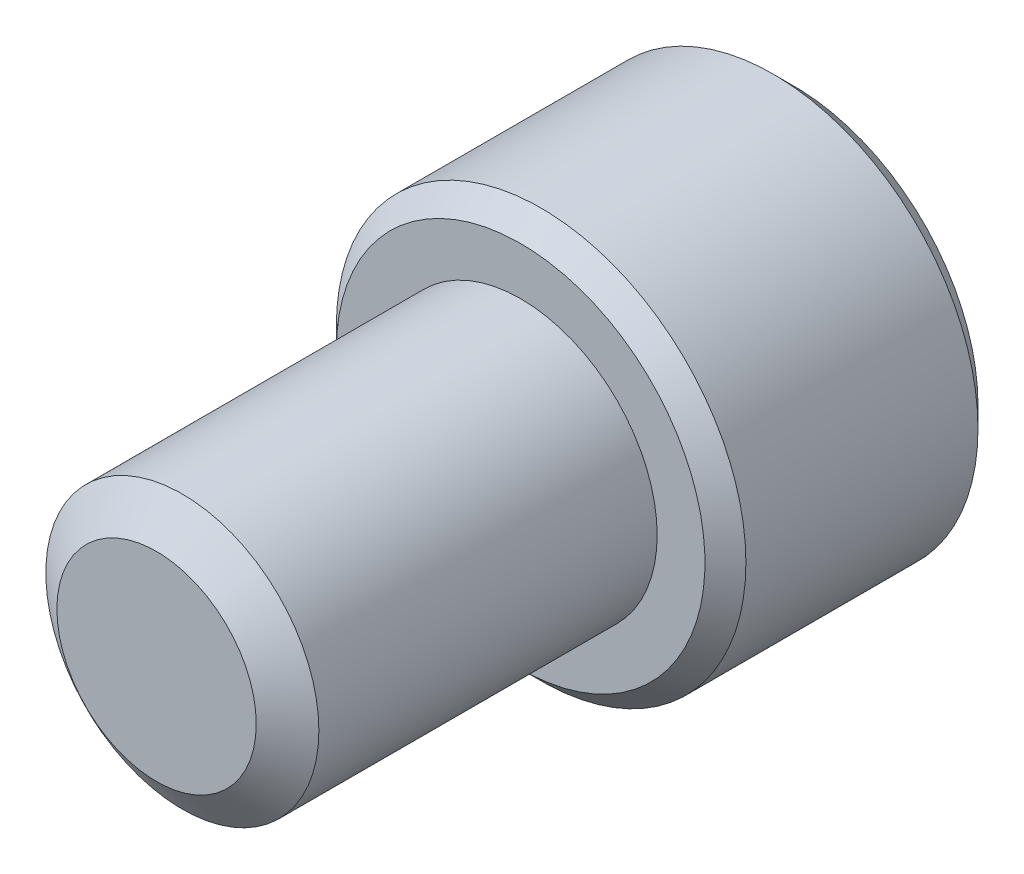
ISO-10303-21;
HEADER;
FILE_DESCRIPTION(('STEP AP214'),'2;1');
FILE_NAME('part.step','',(''),(''),'','','');
FILE_SCHEMA(('AUTOMOTIVE_DESIGN { 1 0 10303 214 1 1 1 1 }'));
ENDSEC;
DATA;
#1=APPLICATION_CONTEXT('core data for automotive mechanical design processes');
#2=APPLICATION_PROTOCOL_DEFINITION('international standard','automotive_design',2000,#1);
#3=PRODUCT_CONTEXT('',#1,'mechanical');
#4=PRODUCT('Part','Part','',(#3));
#5=PRODUCT_RELATED_PRODUCT_CATEGORY('part','',(#4));
#6=PRODUCT_DEFINITION_FORMATION('','',#4);
#7=PRODUCT_DEFINITION_CONTEXT('part definition',#1,'design');
#8=PRODUCT_DEFINITION('design','',#6,#7);
#9=PRODUCT_DEFINITION_SHAPE('','',#8);
#10=(LENGTH_UNIT() NAMED_UNIT(*) SI_UNIT(.MILLI.,.METRE.));
#11=(NAMED_UNIT(*) PLANE_ANGLE_UNIT() SI_UNIT($,.RADIAN.));
#12=(NAMED_UNIT(*) SI_UNIT($,.STERADIAN.) SOLID_ANGLE_UNIT());
#13=UNCERTAINTY_MEASURE_WITH_UNIT(LENGTH_MEASURE(1.E-05),#10,'distance_accuracy_value','');
#14=(GEOMETRIC_REPRESENTATION_CONTEXT(3) GLOBAL_UNCERTAINTY_ASSIGNED_CONTEXT((#13)) GLOBAL_UNIT_ASSIGNED_CONTEXT((#10,
#11,#12)) REPRESENTATION_CONTEXT('',''));
#15=CARTESIAN_POINT('',(0.,0.,0.));
#16=DIRECTION('',(0.,0.,1.));
#17=DIRECTION('',(1.,0.,0.));
#18=AXIS2_PLACEMENT_3D('',#15,#16,#17);
#19=CARTESIAN_POINT('',(0.,0.,-12.7));
#20=DIRECTION('',(0.,0.,1.));
#21=DIRECTION('',(1.,0.,0.));
#22=AXIS2_PLACEMENT_3D('',#19,#20,#21);
#23=CYLINDRICAL_SURFACE('',#22,4.7625);
#24=CARTESIAN_POINT('',(0.,0.,-12.7));
#25=DIRECTION('',(0.,0.,-1.));
#26=DIRECTION('',(-1.,0.,0.));
#27=AXIS2_PLACEMENT_3D('',#24,#25,#26);
#28=CIRCLE('',#27,4.7625);
#29=CARTESIAN_POINT('',(-4.7625,0.,-12.7));
#30=VERTEX_POINT('',#29);
#31=EDGE_CURVE('E217',#30,#30,#28,.F.);
#32=ORIENTED_EDGE('',*,*,#31,.T.);
#33=EDGE_LOOP('',(#32));
#34=FACE_BOUND('',#33,.T.);
#35=CARTESIAN_POINT('',(0.,0.,-0.899844757205829));
#36=DIRECTION('',(0.,0.,1.));
#37=DIRECTION('',(1.,0.,0.));
#38=AXIS2_PLACEMENT_3D('',#35,#36,#37);
#39=CIRCLE('',#38,4.7625);
#40=CARTESIAN_POINT('',(4.7625,0.,-0.899844757205829));
#41=VERTEX_POINT('',#40);
#42=EDGE_CURVE('E111',#41,#41,#39,.T.);
#43=ORIENTED_EDGE('',*,*,#42,.F.);
#44=EDGE_LOOP('',(#43));
#45=FACE_BOUND('',#44,.T.);
#46=ADVANCED_FACE('F37',(#34,#45),#23,.T.);
#47=CARTESIAN_POINT('',(0.,0.,0.));
#48=DIRECTION('',(0.,0.,-1.));
#49=DIRECTION('',(-1.,0.,0.));
#50=AXIS2_PLACEMENT_3D('',#47,#48,#49);
#51=CONICAL_SURFACE('',#50,3.47738850361915,0.959931088596884);
#52=ORIENTED_EDGE('',*,*,#42,.T.);
#53=EDGE_LOOP('',(#52));
#54=FACE_BOUND('',#53,.T.);
#55=CARTESIAN_POINT('',(0.,0.,0.));
#56=DIRECTION('',(0.,0.,1.));
#57=DIRECTION('',(1.,0.,0.));
#58=AXIS2_PLACEMENT_3D('',#55,#56,#57);
#59=CIRCLE('',#58,3.47738850361915);
#60=CARTESIAN_POINT('',(3.47738850361915,0.,0.));
#61=VERTEX_POINT('',#60);
#62=EDGE_CURVE('E215',#61,#61,#59,.T.);
#63=ORIENTED_EDGE('',*,*,#62,.F.);
#64=EDGE_LOOP('',(#63));
#65=FACE_BOUND('',#64,.T.);
#66=ADVANCED_FACE('F198',(#54,#65),#51,.T.);
#67=CARTESIAN_POINT('',(0.,0.,0.));
#68=DIRECTION('',(0.,0.,1.));
#69=DIRECTION('',(1.,0.,0.));
#70=AXIS2_PLACEMENT_3D('',#67,#68,#69);
#71=PLANE('',#70);
#72=ORIENTED_EDGE('',*,*,#62,.T.);
#73=EDGE_LOOP('',(#72));
#74=FACE_BOUND('',#73,.T.);
#75=ADVANCED_FACE('F195',(#74),#71,.T.);
#76=CARTESIAN_POINT('',(0.,0.,-22.225));
#77=DIRECTION('',(0.,0.,1.));
#78=DIRECTION('',(1.,0.,0.));
#79=AXIS2_PLACEMENT_3D('',#76,#77,#78);
#80=CYLINDRICAL_SURFACE('',#79,7.14375);
#81=CARTESIAN_POINT('',(0.,0.,-21.510625));
#82=DIRECTION('',(0.,0.,-1.));
#83=DIRECTION('',(-1.,0.,0.));
#84=AXIS2_PLACEMENT_3D('',#81,#82,#83);
#85=CIRCLE('',#84,7.14375);
#86=CARTESIAN_POINT('',(7.14375,0.,-21.510625));
#87=VERTEX_POINT('',#86);
#88=EDGE_CURVE('E45',#87,#87,#85,.F.);
#89=CARTESIAN_POINT('',(0.,0.,-13.414375));
#90=DIRECTION('',(0.,0.,-1.));
#91=DIRECTION('',(-1.,0.,0.));
#92=AXIS2_PLACEMENT_3D('',#89,#90,#91);
#93=CIRCLE('',#92,7.14375);
#94=CARTESIAN_POINT('',(7.14375,0.,-13.414375));
#95=VERTEX_POINT('',#94);
#96=EDGE_CURVE('E174',#95,#95,#93,.T.);
#97=CARTESIAN_POINT('',(7.14375,0.,-21.510625));
#98=CARTESIAN_POINT('',(7.14375,0.,-21.4262890625));
#99=CARTESIAN_POINT('',(7.14375,0.,-21.341953125));
#100=CARTESIAN_POINT('',(7.14375,0.,-21.17328125));
#101=CARTESIAN_POINT('',(7.14375,0.,-21.0889453125));
#102=CARTESIAN_POINT('',(7.14375,0.,-20.9202734375));
#103=CARTESIAN_POINT('',(7.14375,0.,-20.8359375));
#104=CARTESIAN_POINT('',(7.14375,0.,-20.667265625));
#105=CARTESIAN_POINT('',(7.14375,0.,-20.5829296875));
#106=CARTESIAN_POINT('',(7.14375,0.,-20.4142578125));
#107=CARTESIAN_POINT('',(7.14375,0.,-20.329921875));
#108=CARTESIAN_POINT('',(7.14375,0.,-20.16125));
#109=CARTESIAN_POINT('',(7.14375,0.,-20.0769140625));
#110=CARTESIAN_POINT('',(7.14375,0.,-19.9082421875));
#111=CARTESIAN_POINT('',(7.14375,0.,-19.82390625));
#112=CARTESIAN_POINT('',(7.14375,0.,-19.655234375));
#113=CARTESIAN_POINT('',(7.14375,0.,-19.5708984375));
#114=CARTESIAN_POINT('',(7.14375,0.,-19.4022265625));
#115=CARTESIAN_POINT('',(7.14375,0.,-19.317890625));
#116=CARTESIAN_POINT('',(7.14375,0.,-19.14921875));
#117=CARTESIAN_POINT('',(7.14375,0.,-19.0648828125));
#118=CARTESIAN_POINT('',(7.14375,0.,-18.8962109375));
#119=CARTESIAN_POINT('',(7.14375,0.,-18.811875));
#120=CARTESIAN_POINT('',(7.14375,0.,-18.643203125));
#121=CARTESIAN_POINT('',(7.14375,0.,-18.5588671875));
#122=CARTESIAN_POINT('',(7.14375,0.,-18.3901953125));
#123=CARTESIAN_POINT('',(7.14375,0.,-18.305859375));
#124=CARTESIAN_POINT('',(7.14375,0.,-18.1371875));
#125=CARTESIAN_POINT('',(7.14375,0.,-18.0528515625));
#126=CARTESIAN_POINT('',(7.14375,0.,-17.8841796875));
#127=CARTESIAN_POINT('',(7.14375,0.,-17.79984375));
#128=CARTESIAN_POINT('',(7.14375,0.,-17.631171875));
#129=CARTESIAN_POINT('',(7.14375,0.,-17.5468359375));
#130=CARTESIAN_POINT('',(7.14375,0.,-17.3781640625));
#131=CARTESIAN_POINT('',(7.14375,0.,-17.293828125));
#132=CARTESIAN_POINT('',(7.14375,0.,-17.12515625));
#133=CARTESIAN_POINT('',(7.14375,0.,-17.0408203125));
#134=CARTESIAN_POINT('',(7.14375,0.,-16.8721484375));
#135=CARTESIAN_POINT('',(7.14375,0.,-16.7878125));
#136=CARTESIAN_POINT('',(7.14375,0.,-16.619140625));
#137=CARTESIAN_POINT('',(7.14375,0.,-16.5348046875));
#138=CARTESIAN_POINT('',(7.14375,0.,-16.3661328125));
#139=CARTESIAN_POINT('',(7.14375,0.,-16.281796875));
#140=CARTESIAN_POINT('',(7.14375,0.,-16.113125));
#141=CARTESIAN_POINT('',(7.14375,0.,-16.0287890625));
#142=CARTESIAN_POINT('',(7.14375,0.,-15.8601171875));
#143=CARTESIAN_POINT('',(7.14375,0.,-15.77578125));
#144=CARTESIAN_POINT('',(7.14375,0.,-15.607109375));
#145=CARTESIAN_POINT('',(7.14375,0.,-15.5227734375));
#146=CARTESIAN_POINT('',(7.14375,0.,-15.3541015625));
#147=CARTESIAN_POINT('',(7.14375,0.,-15.269765625));
#148=CARTESIAN_POINT('',(7.14375,0.,-15.10109375));
#149=CARTESIAN_POINT('',(7.14375,0.,-15.0167578125));
#150=CARTESIAN_POINT('',(7.14375,0.,-14.8480859375));
#151=CARTESIAN_POINT('',(7.14375,0.,-14.76375));
#152=CARTESIAN_POINT('',(7.14375,0.,-14.595078125));
#153=CARTESIAN_POINT('',(7.14375,0.,-14.5107421875));
#154=CARTESIAN_POINT('',(7.14375,0.,-14.3420703125));
#155=CARTESIAN_POINT('',(7.14375,0.,-14.257734375));
#156=CARTESIAN_POINT('',(7.14375,0.,-14.0890625));
#157=CARTESIAN_POINT('',(7.14375,0.,-14.0047265625));
#158=CARTESIAN_POINT('',(7.14375,0.,-13.8360546875));
#159=CARTESIAN_POINT('',(7.14375,0.,-13.75171875));
#160=CARTESIAN_POINT('',(7.14375,0.,-13.583046875));
#161=CARTESIAN_POINT('',(7.14375,0.,-13.4987109375));
#162=CARTESIAN_POINT('',(7.14375,0.,-13.414375));
#163=B_SPLINE_CURVE_WITH_KNOTS('',3,(#97,#98,#99,#100,#101,#102,#103,#104,#105,#106,#107,#108,
#109,#110,#111,#112,#113,#114,#115,#116,#117,#118,#119,#120,#121,#122,#123,#124,#125,#126,#127,
#128,#129,#130,#131,#132,#133,#134,#135,#136,#137,#138,#139,#140,#141,#142,#143,#144,#145,#146,
#147,#148,#149,#150,#151,#152,#153,#154,#155,#156,#157,#158,#159,#160,#161,#162),.UNSPECIFIED.,
.F.,.F.,(4,2,2,2,2,2,2,2,2,2,2,2,2,2,2,2,2,2,2,2,2,2,2,2,2,2,2,2,2,2,2,2,4),(0.,
0.253007812499997,0.506015624999998,0.759023437499999,1.01203125,1.2650390625,1.518046875,
1.7710546875,2.0240625,2.2770703125,2.53007812499999,2.7830859375,3.03609375,3.2891015625,
3.54210937499999,3.7951171875,4.048125,4.30113281249999,4.55414062499999,4.8071484375,
5.06015624999999,5.31316406249999,5.56617187499999,5.81917968749999,6.07218749999999,
6.32519531249999,6.57820312499999,6.83121093749999,7.08421874999999,7.33722656249999,
7.59023437499999,7.84324218749999,8.09624999999999),.UNSPECIFIED.);
#164=EDGE_CURVE('BSEAM179',#87,#95,#163,.T.);
#165=ORIENTED_EDGE('',*,*,#88,.T.);
#166=ORIENTED_EDGE('',*,*,#96,.T.);
#167=ORIENTED_EDGE('',*,*,#164,.T.);
#168=ORIENTED_EDGE('',*,*,#164,.F.);
#169=EDGE_LOOP('',(#165,#167,#166,#168));
#170=FACE_BOUND('',#169,.T.);
#171=ADVANCED_FACE('F179',(#170),#80,.T.);
#172=CARTESIAN_POINT('',(0.,0.,-22.225));
#173=DIRECTION('',(0.,0.,-1.));
#174=DIRECTION('',(-1.,0.,0.));
#175=AXIS2_PLACEMENT_3D('',#172,#173,#174);
#176=PLANE('',#175);
#177=CARTESIAN_POINT('',(0.,0.,-22.225));
#178=DIRECTION('',(0.,0.,-1.));
#179=DIRECTION('',(-1.,0.,0.));
#180=AXIS2_PLACEMENT_3D('',#177,#178,#179);
#181=CIRCLE('',#180,6.42937500000001);
#182=CARTESIAN_POINT('',(-6.42937500000001,0.,-22.225));
#183=VERTEX_POINT('',#182);
#184=EDGE_CURVE('E110',#183,#183,#181,.T.);
#185=ORIENTED_EDGE('',*,*,#184,.T.);
#186=EDGE_LOOP('',(#185));
#187=FACE_BOUND('',#186,.T.);
#188=CARTESIAN_POINT('',(0.,0.,-22.225));
#189=DIRECTION('',(0.,0.,-1.));
#190=DIRECTION('',(-1.,0.,0.));
#191=AXIS2_PLACEMENT_3D('',#188,#189,#190);
#192=CIRCLE('',#191,4.58271776169265);
#193=CARTESIAN_POINT('',(-3.96875,2.29135888084633,-22.225));
#194=VERTEX_POINT('',#193);
#195=CARTESIAN_POINT('',(0.,4.58271776169266,-22.225));
#196=VERTEX_POINT('',#195);
#197=EDGE_CURVE('E91',#194,#196,#192,.T.);
#198=ORIENTED_EDGE('',*,*,#197,.F.);
#199=CARTESIAN_POINT('',(-3.96875,-2.29135888084633,-22.225));
#200=VERTEX_POINT('',#199);
#201=EDGE_CURVE('E51',#200,#194,#192,.T.);
#202=ORIENTED_EDGE('',*,*,#201,.F.);
#203=CARTESIAN_POINT('',(0.,-4.58271776169265,-22.225));
#204=VERTEX_POINT('',#203);
#205=EDGE_CURVE('E276',#204,#200,#192,.T.);
#206=ORIENTED_EDGE('',*,*,#205,.F.);
#207=CARTESIAN_POINT('',(3.96875,-2.29135888084633,-22.225));
#208=VERTEX_POINT('',#207);
#209=EDGE_CURVE('E58',#208,#204,#192,.T.);
#210=ORIENTED_EDGE('',*,*,#209,.F.);
#211=CARTESIAN_POINT('',(3.96875,2.29135888084633,-22.225));
#212=VERTEX_POINT('',#211);
#213=EDGE_CURVE('E132',#212,#208,#192,.T.);
#214=ORIENTED_EDGE('',*,*,#213,.F.);
#215=EDGE_CURVE('E100',#196,#212,#192,.T.);
#216=ORIENTED_EDGE('',*,*,#215,.F.);
#217=EDGE_LOOP('',(#198,#202,#206,#210,#214,#216));
#218=FACE_BOUND('',#217,.T.);
#219=ADVANCED_FACE('F131',(#187,#218),#176,.T.);
#220=CARTESIAN_POINT('',(0.,0.,-12.7));
#221=DIRECTION('',(0.,0.,-1.));
#222=DIRECTION('',(-1.,0.,0.));
#223=AXIS2_PLACEMENT_3D('',#220,#221,#222);
#224=PLANE('',#223);
#225=CARTESIAN_POINT('',(0.,0.,-12.7));
#226=DIRECTION('',(0.,0.,-1.));
#227=DIRECTION('',(-1.,0.,0.));
#228=AXIS2_PLACEMENT_3D('',#225,#226,#227);
#229=CIRCLE('',#228,6.42937499999999);
#230=CARTESIAN_POINT('',(-6.42937499999999,0.,-12.7));
#231=VERTEX_POINT('',#230);
#232=EDGE_CURVE('E11',#231,#231,#229,.F.);
#233=ORIENTED_EDGE('',*,*,#232,.T.);
#234=EDGE_LOOP('',(#233));
#235=FACE_BOUND('',#234,.T.);
#236=ORIENTED_EDGE('',*,*,#31,.F.);
#237=EDGE_LOOP('',(#236));
#238=FACE_BOUND('',#237,.T.);
#239=ADVANCED_FACE('F188',(#235,#238),#224,.F.);
#240=CARTESIAN_POINT('',(0.,0.,-22.225));
#241=DIRECTION('',(0.,0.,-1.));
#242=DIRECTION('',(-1.,0.,0.));
#243=AXIS2_PLACEMENT_3D('',#240,#241,#242);
#244=CONICAL_SURFACE('',#243,4.58271776169265,0.78539816339745);
#245=ORIENTED_EDGE('',*,*,#215,.T.);
#246=CARTESIAN_POINT('',(-0.00020000000000008,4.58283323174649,-22.225115474418));
#247=CARTESIAN_POINT('',(0.0680436803859713,4.54343272450516,-22.1857190135033));
#248=CARTESIAN_POINT('',(0.136809584821844,4.50373071106804,-22.1475312157826));
#249=CARTESIAN_POINT('',(0.27549341570887,4.42366156397317,-22.0739413714603));
#250=CARTESIAN_POINT('',(0.345411946528988,4.38329408138283,-22.0385408464105));
#251=CARTESIAN_POINT('',(0.557707505859672,4.2607251830555,-21.9367709068352));
#252=CARTESIAN_POINT('',(0.701888834466527,4.17748205417221,-21.8752673400195));
#253=CARTESIAN_POINT('',(0.99258566036739,4.00964816348578,-21.7699392939681));
#254=CARTESIAN_POINT('',(1.13902772950243,3.92509979544998,-21.7258495742591));
#255=CARTESIAN_POINT('',(1.43514553766434,3.75413609919585,-21.6579143133903));
#256=CARTESIAN_POINT('',(1.58481220774579,3.66772600693562,-21.6340180866405));
#257=CARTESIAN_POINT('',(1.84275672965522,3.51880166777522,-21.6124580589113));
#258=CARTESIAN_POINT('',(1.95070224659486,3.45647929451231,-21.6092672072687));
#259=CARTESIAN_POINT('',(2.16641807874268,3.3319357007533,-21.6146459790003));
#260=CARTESIAN_POINT('',(2.27418831927626,3.2697145233706,-21.6232197250599));
#261=CARTESIAN_POINT('',(2.4887076557444,3.14586172671434,-21.6516386528729));
#262=CARTESIAN_POINT('',(2.59545547357325,3.08423084535545,-21.6714964410767));
#263=CARTESIAN_POINT('',(2.80711777437235,2.96202755901179,-21.7213994540715));
#264=CARTESIAN_POINT('',(2.91203239726007,2.90145507324564,-21.7514438977693));
#265=CARTESIAN_POINT('',(3.0982812496352,2.7939242481906,-21.8132572973969));
#266=CARTESIAN_POINT('',(3.18002783101947,2.74672783742306,-21.8434010313299));
#267=CARTESIAN_POINT('',(3.34205349185908,2.65318227852169,-21.9085463964783));
#268=CARTESIAN_POINT('',(3.4223325265843,2.6068331562128,-21.9435481754861));
#269=CARTESIAN_POINT('',(3.58117016791194,2.51512820123484,-22.0176249778602));
#270=CARTESIAN_POINT('',(3.65973329214443,2.46976976031083,-22.0566871925354));
#271=CARTESIAN_POINT('',(3.81540464036892,2.37989286550831,-22.1383719201149));
#272=CARTESIAN_POINT('',(3.89251372186607,2.33537391654896,-22.180992248695));
#273=CARTESIAN_POINT('',(3.96895,2.29124341079249,-22.225115474418));
#274=B_SPLINE_CURVE_WITH_KNOTS('',3,(#246,#247,#248,#249,#250,#251,#252,#253,#254,#255,#256,
#257,#258,#259,#260,#261,#262,#263,#264,#265,#266,#267,#268,#269,#270,#271,#272,#273),
.UNSPECIFIED.,.F.,.F.,(4,2,2,2,2,2,2,2,2,2,2,2,2,4),(0.,0.264281222504262,0.5287057281046,
1.06040984450884,1.58367029033774,2.10561342008457,2.47914251806345,2.85280254583609,
3.22688084694381,3.60093047093423,3.89805841615096,4.19519540263381,4.49142198422536,
4.78746803121399),.UNSPECIFIED.);
#275=EDGE_CURVE('E105',#196,#212,#274,.T.);
#276=ORIENTED_EDGE('',*,*,#275,.F.);
#277=EDGE_LOOP('',(#245,#276));
#278=FACE_BOUND('',#277,.T.);
#279=ADVANCED_FACE('F106',(#278),#244,.F.);
#280=ORIENTED_EDGE('',*,*,#213,.T.);
#281=CARTESIAN_POINT('',(3.96875,-4.56990484315645,-23.6949681576331));
#282=CARTESIAN_POINT('',(3.96875,-4.45863268424877,-23.6109744466099));
#283=CARTESIAN_POINT('',(3.96875,-4.34673751853659,-23.5277926459744));
#284=CARTESIAN_POINT('',(3.96875,-4.12145541759773,-23.3634163849863));
#285=CARTESIAN_POINT('',(3.96875,-4.00806811494044,-23.2822224287616));
#286=CARTESIAN_POINT('',(3.96875,-3.77872655840531,-23.1216080907353));
#287=CARTESIAN_POINT('',(3.96875,-3.66275922236845,-23.0422063256494));
#288=CARTESIAN_POINT('',(3.96875,-3.42885613076908,-22.8863665390494));
#289=CARTESIAN_POINT('',(3.96875,-3.31092051512029,-22.8099283081475));
#290=CARTESIAN_POINT('',(3.96875,-3.06596138286377,-22.6564091143357));
#291=CARTESIAN_POINT('',(3.96875,-2.9388037115444,-22.5795411250438));
#292=CARTESIAN_POINT('',(3.96875,-2.68152025411326,-22.4308625301378));
#293=CARTESIAN_POINT('',(3.96875,-2.55139400205451,-22.3590527257855));
#294=CARTESIAN_POINT('',(3.96875,-2.288185487324,-22.2220399077643));
#295=CARTESIAN_POINT('',(3.96875,-2.15511341733938,-22.1568174667664));
#296=CARTESIAN_POINT('',(3.96875,-1.88534004741321,-22.0344394622814));
#297=CARTESIAN_POINT('',(3.96875,-1.74864042427225,-21.9772802462412));
#298=CARTESIAN_POINT('',(3.96875,-1.48255876318204,-21.8772577192134));
#299=CARTESIAN_POINT('',(3.96875,-1.35347311146701,-21.833614131207));
#300=CARTESIAN_POINT('',(3.96875,-1.09219394236274,-21.7566829186578));
#301=CARTESIAN_POINT('',(3.96875,-0.960000211544505,-21.7233960075458));
#302=CARTESIAN_POINT('',(3.96875,-0.695492941340558,-21.6694702438101));
#303=CARTESIAN_POINT('',(3.96875,-0.563224314368353,-21.6486146869745));
#304=CARTESIAN_POINT('',(3.96875,-0.297273068724064,-21.6199564272277));
#305=CARTESIAN_POINT('',(3.96875,-0.163590697091781,-21.6121514805561));
#306=CARTESIAN_POINT('',(3.96875,0.0990312688457112,-21.610174091002));
#307=CARTESIAN_POINT('',(3.96875,0.227967389962748,-21.6155184349991));
#308=CARTESIAN_POINT('',(3.96875,0.48473519195116,-21.6384783437385));
#309=CARTESIAN_POINT('',(3.96875,0.612566764309973,-21.6560951005717));
#310=CARTESIAN_POINT('',(3.96875,0.868361511021708,-21.7029383689789));
#311=CARTESIAN_POINT('',(3.96875,0.996287921705627,-21.732362449144));
#312=CARTESIAN_POINT('',(3.96875,1.24935336573866,-21.8012511262479));
#313=CARTESIAN_POINT('',(3.96875,1.37449263136589,-21.8407148830583));
#314=CARTESIAN_POINT('',(3.96875,1.63331643386752,-21.9321181464302));
#315=CARTESIAN_POINT('',(3.96875,1.76670819120342,-21.9848783645525));
#316=CARTESIAN_POINT('',(3.96875,2.03002683124387,-22.0984987064253));
#317=CARTESIAN_POINT('',(3.96875,2.15995206580511,-22.1593626034686));
#318=CARTESIAN_POINT('',(3.96875,2.4169726125533,-22.2877422212948));
#319=CARTESIAN_POINT('',(3.96875,2.54405740766774,-22.3552788281663));
#320=CARTESIAN_POINT('',(3.96875,2.7953024456765,-22.4955111262514));
#321=CARTESIAN_POINT('',(3.96875,2.91946314953283,-22.5682059969522));
#322=CARTESIAN_POINT('',(3.96875,3.15913302861405,-22.7140188944929));
#323=CARTESIAN_POINT('',(3.96875,3.27476522917588,-22.7869357740221));
#324=CARTESIAN_POINT('',(3.96875,3.50404450455156,-22.9358358118069));
#325=CARTESIAN_POINT('',(3.96875,3.61769142806587,-23.0118192023156));
#326=CARTESIAN_POINT('',(3.96875,3.84233840610168,-23.1656765206122));
#327=CARTESIAN_POINT('',(3.96875,3.95335246245717,-23.243530077566));
#328=CARTESIAN_POINT('',(3.96875,4.17386344212358,-23.4012960406035));
#329=CARTESIAN_POINT('',(3.96875,4.28336077424872,-23.4812078746187));
#330=CARTESIAN_POINT('',(3.96875,4.39222298093245,-23.5619612225709));
#331=B_SPLINE_CURVE_WITH_KNOTS('',3,(#281,#282,#283,#284,#285,#286,#287,#288,#289,#290,#291,
#292,#293,#294,#295,#296,#297,#298,#299,#300,#301,#302,#303,#304,#305,#306,#307,#308,#309,#310,
#311,#312,#313,#314,#315,#316,#317,#318,#319,#320,#321,#322,#323,#324,#325,#326,#327,#328,#329,
#330),.UNSPECIFIED.,.F.,.F.,(4,2,2,2,2,2,2,2,2,2,2,2,2,2,2,2,2,2,2,2,2,2,2,2,4),(0.,
0.418252140016642,0.836609274713138,1.25820795995599,1.67977680274237,2.12544086340516,
2.5711753632218,3.01555437338786,3.45973143381404,3.86816421344645,4.27662512218098,
4.67774000873369,5.0787859254598,5.46531568646291,5.85188299858476,6.24520796039677,
6.63850001927392,7.06850560534098,7.49871211849048,7.9303106517192,8.36184068483129,
8.77189246592985,9.1819753622517,9.5887271056262,9.99536699280668),.UNSPECIFIED.);
#332=EDGE_CURVE('E99',#212,#208,#331,.F.);
#333=ORIENTED_EDGE('',*,*,#332,.F.);
#334=EDGE_LOOP('',(#280,#333));
#335=FACE_BOUND('',#334,.T.);
#336=ADVANCED_FACE('F282',(#335),#244,.F.);
#337=ORIENTED_EDGE('',*,*,#209,.T.);
#338=CARTESIAN_POINT('',(3.96895,-2.29124341079249,-22.225115474418));
#339=CARTESIAN_POINT('',(3.90070631961403,-2.33064391803382,-22.1857190135033));
#340=CARTESIAN_POINT('',(3.83194041517816,-2.37034593147094,-22.1475312157826));
#341=CARTESIAN_POINT('',(3.69325658429113,-2.45041507856581,-22.0739413714603));
#342=CARTESIAN_POINT('',(3.62333805347101,-2.49078256115615,-22.0385408464105));
#343=CARTESIAN_POINT('',(3.41104249414033,-2.61335145948348,-21.9367709068352));
#344=CARTESIAN_POINT('',(3.26686116553347,-2.69659458836677,-21.8752673400195));
#345=CARTESIAN_POINT('',(2.97616433963261,-2.8644284790532,-21.7699392939681));
#346=CARTESIAN_POINT('',(2.82972227049758,-2.948976847089,-21.7258495742591));
#347=CARTESIAN_POINT('',(2.53360446233566,-3.11994054334313,-21.6579143133903));
#348=CARTESIAN_POINT('',(2.38393779225422,-3.20635063560336,-21.6340180866405));
#349=CARTESIAN_POINT('',(2.12599327034478,-3.35527497476376,-21.6124580589113));
#350=CARTESIAN_POINT('',(2.01804775340515,-3.41759734802667,-21.6092672072687));
#351=CARTESIAN_POINT('',(1.80233192125732,-3.54214094178568,-21.6146459790003));
#352=CARTESIAN_POINT('',(1.69456168072374,-3.60436211916838,-21.6232197250599));
#353=CARTESIAN_POINT('',(1.4800423442556,-3.72821491582464,-21.6516386528729));
#354=CARTESIAN_POINT('',(1.37329452642676,-3.78984579718353,-21.6714964410767));
#355=CARTESIAN_POINT('',(1.16163222562765,-3.91204908352719,-21.7213994540715));
#356=CARTESIAN_POINT('',(1.05671760273993,-3.97262156929334,-21.7514438977693));
#357=CARTESIAN_POINT('',(0.870468750364803,-4.08015239434838,-21.8132572973969));
#358=CARTESIAN_POINT('',(0.788722168980529,-4.12734880511592,-21.8434010313299));
#359=CARTESIAN_POINT('',(0.626696508140925,-4.22089436401729,-21.9085463964783));
#360=CARTESIAN_POINT('',(0.546417473415704,-4.26724348632618,-21.9435481754861));
#361=CARTESIAN_POINT('',(0.387579832088066,-4.35894844130414,-22.0176249778602));
#362=CARTESIAN_POINT('',(0.309016707855576,-4.40430688222815,-22.0566871925354));
#363=CARTESIAN_POINT('',(0.153345359631081,-4.49418377703067,-22.1383719201149));
#364=CARTESIAN_POINT('',(0.0762362781339246,-4.53870272599002,-22.180992248695));
#365=CARTESIAN_POINT('',(-0.000200000000000287,-4.58283323174649,-22.225115474418));
#366=B_SPLINE_CURVE_WITH_KNOTS('',3,(#338,#339,#340,#341,#342,#343,#344,#345,#346,#347,#348,
#349,#350,#351,#352,#353,#354,#355,#356,#357,#358,#359,#360,#361,#362,#363,#364,#365),
.UNSPECIFIED.,.F.,.F.,(4,2,2,2,2,2,2,2,2,2,2,2,2,4),(0.,0.264281222504262,0.528705728104598,
1.06040984450884,1.58367029033774,2.10561342008456,2.47914251806345,2.85280254583609,
3.22688084694381,3.60093047093423,3.89805841615096,4.19519540263381,4.49142198422536,
4.78746803121399),.UNSPECIFIED.);
#367=EDGE_CURVE('E142',#208,#204,#366,.T.);
#368=ORIENTED_EDGE('',*,*,#367,.F.);
#369=EDGE_LOOP('',(#337,#368));
#370=FACE_BOUND('',#369,.T.);
#371=ADVANCED_FACE('F279',(#370),#244,.F.);
#372=ORIENTED_EDGE('',*,*,#205,.T.);
#373=CARTESIAN_POINT('',(0.000200000000000329,-4.58283323174649,-22.225115474418));
#374=CARTESIAN_POINT('',(-0.0680436803859701,-4.54343272450516,-22.1857190135033));
#375=CARTESIAN_POINT('',(-0.136809584821843,-4.50373071106804,-22.1475312157826));
#376=CARTESIAN_POINT('',(-0.27549341570887,-4.42366156397317,-22.0739413714603));
#377=CARTESIAN_POINT('',(-0.345411946528988,-4.38329408138283,-22.0385408464105));
#378=CARTESIAN_POINT('',(-0.557707505859673,-4.2607251830555,-21.9367709068352));
#379=CARTESIAN_POINT('',(-0.701888834466526,-4.17748205417221,-21.8752673400195));
#380=CARTESIAN_POINT('',(-0.992585660367389,-4.00964816348578,-21.7699392939681));
#381=CARTESIAN_POINT('',(-1.13902772950242,-3.92509979544998,-21.7258495742591));
#382=CARTESIAN_POINT('',(-1.43514553766434,-3.75413609919586,-21.6579143133903));
#383=CARTESIAN_POINT('',(-1.58481220774579,-3.66772600693562,-21.6340180866405));
#384=CARTESIAN_POINT('',(-1.84275672965522,-3.51880166777522,-21.6124580589113));
#385=CARTESIAN_POINT('',(-1.95070224659486,-3.45647929451231,-21.6092672072687));
#386=CARTESIAN_POINT('',(-2.16641807874268,-3.3319357007533,-21.6146459790003));
#387=CARTESIAN_POINT('',(-2.27418831927626,-3.2697145233706,-21.6232197250599));
#388=CARTESIAN_POINT('',(-2.4887076557444,-3.14586172671434,-21.6516386528729));
#389=CARTESIAN_POINT('',(-2.59545547357325,-3.08423084535545,-21.6714964410767));
#390=CARTESIAN_POINT('',(-2.80711777437235,-2.96202755901179,-21.7213994540715));
#391=CARTESIAN_POINT('',(-2.91203239726007,-2.90145507324564,-21.7514438977693));
#392=CARTESIAN_POINT('',(-3.0982812496352,-2.7939242481906,-21.8132572973969));
#393=CARTESIAN_POINT('',(-3.18002783101947,-2.74672783742306,-21.8434010313299));
#394=CARTESIAN_POINT('',(-3.34205349185908,-2.65318227852169,-21.9085463964783));
#395=CARTESIAN_POINT('',(-3.4223325265843,-2.6068331562128,-21.9435481754861));
#396=CARTESIAN_POINT('',(-3.58117016791194,-2.51512820123484,-22.0176249778602));
#397=CARTESIAN_POINT('',(-3.65973329214443,-2.46976976031084,-22.0566871925354));
#398=CARTESIAN_POINT('',(-3.81540464036892,-2.37989286550831,-22.1383719201149));
#399=CARTESIAN_POINT('',(-3.89251372186607,-2.33537391654897,-22.180992248695));
#400=CARTESIAN_POINT('',(-3.96895,-2.29124341079249,-22.225115474418));
#401=B_SPLINE_CURVE_WITH_KNOTS('',3,(#373,#374,#375,#376,#377,#378,#379,#380,#381,#382,#383,
#384,#385,#386,#387,#388,#389,#390,#391,#392,#393,#394,#395,#396,#397,#398,#399,#400),
.UNSPECIFIED.,.F.,.F.,(4,2,2,2,2,2,2,2,2,2,2,2,2,4),(0.,0.264281222504264,0.528705728104599,
1.06040984450885,1.58367029033774,2.10561342008457,2.47914251806345,2.85280254583609,
3.22688084694382,3.60093047093423,3.89805841615096,4.19519540263381,4.49142198422536,
4.78746803121399),.UNSPECIFIED.);
#402=EDGE_CURVE('E253',#204,#200,#401,.T.);
#403=ORIENTED_EDGE('',*,*,#402,.F.);
#404=EDGE_LOOP('',(#372,#403));
#405=FACE_BOUND('',#404,.T.);
#406=ADVANCED_FACE('F278',(#405),#244,.F.);
#407=ORIENTED_EDGE('',*,*,#201,.T.);
#408=CARTESIAN_POINT('',(-3.96875,-4.56990484315645,-23.6949681576331));
#409=CARTESIAN_POINT('',(-3.96875,-4.45863268424877,-23.6109744466099));
#410=CARTESIAN_POINT('',(-3.96875,-4.34673751853659,-23.5277926459744));
#411=CARTESIAN_POINT('',(-3.96875,-4.12145541759773,-23.3634163849863));
#412=CARTESIAN_POINT('',(-3.96875,-4.00806811494044,-23.2822224287616));
#413=CARTESIAN_POINT('',(-3.96875,-3.77872655840531,-23.1216080907353));
#414=CARTESIAN_POINT('',(-3.96875,-3.66275922236845,-23.0422063256494));
#415=CARTESIAN_POINT('',(-3.96875,-3.42885613076908,-22.8863665390494));
#416=CARTESIAN_POINT('',(-3.96875,-3.31092051512029,-22.8099283081475));
#417=CARTESIAN_POINT('',(-3.96875,-3.06596138286377,-22.6564091143357));
#418=CARTESIAN_POINT('',(-3.96875,-2.9388037115444,-22.5795411250438));
#419=CARTESIAN_POINT('',(-3.96875,-2.68152025411326,-22.4308625301378));
#420=CARTESIAN_POINT('',(-3.96875,-2.55139400205451,-22.3590527257855));
#421=CARTESIAN_POINT('',(-3.96875,-2.288185487324,-22.2220399077643));
#422=CARTESIAN_POINT('',(-3.96875,-2.15511341733938,-22.1568174667664));
#423=CARTESIAN_POINT('',(-3.96875,-1.88534004741321,-22.0344394622814));
#424=CARTESIAN_POINT('',(-3.96875,-1.74864042427225,-21.9772802462412));
#425=CARTESIAN_POINT('',(-3.96875,-1.48255876318204,-21.8772577192134));
#426=CARTESIAN_POINT('',(-3.96875,-1.35347311146701,-21.833614131207));
#427=CARTESIAN_POINT('',(-3.96875,-1.09219394236274,-21.7566829186578));
#428=CARTESIAN_POINT('',(-3.96875,-0.960000211544505,-21.7233960075458));
#429=CARTESIAN_POINT('',(-3.96875,-0.695492941340558,-21.6694702438101));
#430=CARTESIAN_POINT('',(-3.96875,-0.563224314368353,-21.6486146869745));
#431=CARTESIAN_POINT('',(-3.96875,-0.297273068724064,-21.6199564272277));
#432=CARTESIAN_POINT('',(-3.96875,-0.163590697091781,-21.6121514805561));
#433=CARTESIAN_POINT('',(-3.96875,0.0990312688457112,-21.610174091002));
#434=CARTESIAN_POINT('',(-3.96875,0.227967389962748,-21.6155184349991));
#435=CARTESIAN_POINT('',(-3.96875,0.48473519195116,-21.6384783437385));
#436=CARTESIAN_POINT('',(-3.96875,0.612566764309973,-21.6560951005717));
#437=CARTESIAN_POINT('',(-3.96875,0.868361511021708,-21.7029383689789));
#438=CARTESIAN_POINT('',(-3.96875,0.996287921705627,-21.732362449144));
#439=CARTESIAN_POINT('',(-3.96875,1.24935336573866,-21.8012511262479));
#440=CARTESIAN_POINT('',(-3.96875,1.37449263136589,-21.8407148830583));
#441=CARTESIAN_POINT('',(-3.96875,1.63331643386752,-21.9321181464302));
#442=CARTESIAN_POINT('',(-3.96875,1.76670819120342,-21.9848783645525));
#443=CARTESIAN_POINT('',(-3.96875,2.03002683124387,-22.0984987064253));
#444=CARTESIAN_POINT('',(-3.96875,2.15995206580511,-22.1593626034686));
#445=CARTESIAN_POINT('',(-3.96875,2.4169726125533,-22.2877422212948));
#446=CARTESIAN_POINT('',(-3.96875,2.54405740766774,-22.3552788281663));
#447=CARTESIAN_POINT('',(-3.96875,2.7953024456765,-22.4955111262514));
#448=CARTESIAN_POINT('',(-3.96875,2.91946314953283,-22.5682059969522));
#449=CARTESIAN_POINT('',(-3.96875,3.15913302861405,-22.7140188944929));
#450=CARTESIAN_POINT('',(-3.96875,3.27476522917588,-22.7869357740221));
#451=CARTESIAN_POINT('',(-3.96875,3.50404450455156,-22.9358358118069));
#452=CARTESIAN_POINT('',(-3.96875,3.61769142806587,-23.0118192023156));
#453=CARTESIAN_POINT('',(-3.96875,3.84233840610168,-23.1656765206122));
#454=CARTESIAN_POINT('',(-3.96875,3.95335246245717,-23.243530077566));
#455=CARTESIAN_POINT('',(-3.96875,4.17386344212358,-23.4012960406035));
#456=CARTESIAN_POINT('',(-3.96875,4.28336077424872,-23.4812078746187));
#457=CARTESIAN_POINT('',(-3.96875,4.39222298093245,-23.5619612225709));
#458=B_SPLINE_CURVE_WITH_KNOTS('',3,(#408,#409,#410,#411,#412,#413,#414,#415,#416,#417,#418,
#419,#420,#421,#422,#423,#424,#425,#426,#427,#428,#429,#430,#431,#432,#433,#434,#435,#436,#437,
#438,#439,#440,#441,#442,#443,#444,#445,#446,#447,#448,#449,#450,#451,#452,#453,#454,#455,#456,
#457),.UNSPECIFIED.,.F.,.F.,(4,2,2,2,2,2,2,2,2,2,2,2,2,2,2,2,2,2,2,2,2,2,2,2,4),(0.,
0.418252140016642,0.836609274713138,1.25820795995599,1.67977680274237,2.12544086340516,
2.5711753632218,3.01555437338786,3.45973143381404,3.86816421344645,4.27662512218098,
4.67774000873369,5.0787859254598,5.46531568646291,5.85188299858476,6.24520796039677,
6.63850001927392,7.06850560534098,7.49871211849048,7.9303106517192,8.36184068483129,
8.77189246592985,9.1819753622517,9.5887271056262,9.99536699280668),.UNSPECIFIED.);
#459=EDGE_CURVE('E121',#200,#194,#458,.T.);
#460=ORIENTED_EDGE('',*,*,#459,.F.);
#461=EDGE_LOOP('',(#407,#460));
#462=FACE_BOUND('',#461,.T.);
#463=ADVANCED_FACE('F291',(#462),#244,.F.);
#464=ORIENTED_EDGE('',*,*,#197,.T.);
#465=CARTESIAN_POINT('',(-3.96895,2.29124341079249,-22.225115474418));
#466=CARTESIAN_POINT('',(-3.90070631961403,2.33064391803382,-22.1857190135033));
#467=CARTESIAN_POINT('',(-3.83194041517816,2.37034593147094,-22.1475312157826));
#468=CARTESIAN_POINT('',(-3.69325658429113,2.45041507856581,-22.0739413714603));
#469=CARTESIAN_POINT('',(-3.62333805347101,2.49078256115615,-22.0385408464105));
#470=CARTESIAN_POINT('',(-3.41104249414033,2.61335145948349,-21.9367709068352));
#471=CARTESIAN_POINT('',(-3.26686116553347,2.69659458836677,-21.8752673400195));
#472=CARTESIAN_POINT('',(-2.97616433963261,2.8644284790532,-21.7699392939681));
#473=CARTESIAN_POINT('',(-2.82972227049757,2.948976847089,-21.7258495742591));
#474=CARTESIAN_POINT('',(-2.53360446233566,3.11994054334313,-21.6579143133903));
#475=CARTESIAN_POINT('',(-2.38393779225421,3.20635063560336,-21.6340180866405));
#476=CARTESIAN_POINT('',(-2.12599327034478,3.35527497476376,-21.6124580589113));
#477=CARTESIAN_POINT('',(-2.01804775340514,3.41759734802667,-21.6092672072687));
#478=CARTESIAN_POINT('',(-1.80233192125732,3.54214094178569,-21.6146459790003));
#479=CARTESIAN_POINT('',(-1.69456168072374,3.60436211916838,-21.6232197250599));
#480=CARTESIAN_POINT('',(-1.4800423442556,3.72821491582464,-21.6516386528729));
#481=CARTESIAN_POINT('',(-1.37329452642675,3.78984579718353,-21.6714964410767));
#482=CARTESIAN_POINT('',(-1.16163222562765,3.91204908352719,-21.7213994540715));
#483=CARTESIAN_POINT('',(-1.05671760273993,3.97262156929334,-21.7514438977693));
#484=CARTESIAN_POINT('',(-0.870468750364801,4.08015239434838,-21.8132572973969));
#485=CARTESIAN_POINT('',(-0.788722168980527,4.12734880511592,-21.8434010313299));
#486=CARTESIAN_POINT('',(-0.626696508140922,4.22089436401729,-21.9085463964783));
#487=CARTESIAN_POINT('',(-0.546417473415701,4.26724348632618,-21.9435481754861));
#488=CARTESIAN_POINT('',(-0.387579832088064,4.35894844130414,-22.0176249778602));
#489=CARTESIAN_POINT('',(-0.309016707855575,4.40430688222815,-22.0566871925354));
#490=CARTESIAN_POINT('',(-0.153345359631081,4.49418377703067,-22.1383719201149));
#491=CARTESIAN_POINT('',(-0.0762362781339249,4.53870272599002,-22.180992248695));
#492=CARTESIAN_POINT('',(0.000200000000000161,4.58283323174649,-22.225115474418));
#493=B_SPLINE_CURVE_WITH_KNOTS('',3,(#465,#466,#467,#468,#469,#470,#471,#472,#473,#474,#475,
#476,#477,#478,#479,#480,#481,#482,#483,#484,#485,#486,#487,#488,#489,#490,#491,#492),
.UNSPECIFIED.,.F.,.F.,(4,2,2,2,2,2,2,2,2,2,2,2,2,4),(0.,0.264281222504265,0.5287057281046,
1.06040984450885,1.58367029033774,2.10561342008457,2.47914251806345,2.85280254583609,
3.22688084694382,3.60093047093423,3.89805841615096,4.19519540263381,4.49142198422536,
4.78746803121399),.UNSPECIFIED.);
#494=EDGE_CURVE('E95',#194,#196,#493,.T.);
#495=ORIENTED_EDGE('',*,*,#494,.F.);
#496=EDGE_LOOP('',(#464,#495));
#497=FACE_BOUND('',#496,.T.);
#498=ADVANCED_FACE('F93',(#497),#244,.F.);
#499=CARTESIAN_POINT('',(3.96875,6.87407664253898,-16.271875));
#500=DIRECTION('',(0.,0.,-1.));
#501=DIRECTION('',(-1.,0.,0.));
#502=AXIS2_PLACEMENT_3D('',#499,#500,#501);
#503=PLANE('',#502);
#504=DIRECTION('',(0.866025403784439,0.5,0.));
#505=VECTOR('',#504,1.);
#506=CARTESIAN_POINT('',(-3.96875,2.29135888084633,-16.271875));
#507=LINE('',#506,#505);
#508=CARTESIAN_POINT('',(-3.96875,2.29135888084633,-16.271875));
#509=VERTEX_POINT('',#508);
#510=CARTESIAN_POINT('',(0.,4.58271776169265,-16.271875));
#511=VERTEX_POINT('',#510);
#512=EDGE_CURVE('E120',#509,#511,#507,.T.);
#513=ORIENTED_EDGE('',*,*,#512,.T.);
#514=DIRECTION('',(0.866025403784439,-0.5,0.));
#515=VECTOR('',#514,1.);
#516=CARTESIAN_POINT('',(0.,4.58271776169265,-16.271875));
#517=LINE('',#516,#515);
#518=CARTESIAN_POINT('',(3.96875,2.29135888084633,-16.271875));
#519=VERTEX_POINT('',#518);
#520=EDGE_CURVE('E125',#511,#519,#517,.T.);
#521=ORIENTED_EDGE('',*,*,#520,.T.);
#522=DIRECTION('',(0.,-1.,0.));
#523=VECTOR('',#522,1.);
#524=CARTESIAN_POINT('',(3.96875,2.29135888084633,-16.271875));
#525=LINE('',#524,#523);
#526=CARTESIAN_POINT('',(3.96875,-2.29135888084633,-16.271875));
#527=VERTEX_POINT('',#526);
#528=EDGE_CURVE('E239',#519,#527,#525,.T.);
#529=ORIENTED_EDGE('',*,*,#528,.T.);
#530=DIRECTION('',(-0.866025403784439,-0.5,0.));
#531=VECTOR('',#530,1.);
#532=CARTESIAN_POINT('',(3.96875,-2.29135888084633,-16.271875));
#533=LINE('',#532,#531);
#534=CARTESIAN_POINT('',(0.,-4.58271776169265,-16.271875));
#535=VERTEX_POINT('',#534);
#536=EDGE_CURVE('E236',#527,#535,#533,.T.);
#537=ORIENTED_EDGE('',*,*,#536,.T.);
#538=DIRECTION('',(-0.866025403784439,0.5,0.));
#539=VECTOR('',#538,1.);
#540=CARTESIAN_POINT('',(0.,-4.58271776169265,-16.271875));
#541=LINE('',#540,#539);
#542=CARTESIAN_POINT('',(-3.96875,-2.29135888084633,-16.271875));
#543=VERTEX_POINT('',#542);
#544=EDGE_CURVE('E233',#535,#543,#541,.T.);
#545=ORIENTED_EDGE('',*,*,#544,.T.);
#546=DIRECTION('',(0.,1.,0.));
#547=VECTOR('',#546,1.);
#548=CARTESIAN_POINT('',(-3.96875,-2.29135888084633,-16.271875));
#549=LINE('',#548,#547);
#550=EDGE_CURVE('E128',#543,#509,#549,.T.);
#551=ORIENTED_EDGE('',*,*,#550,.T.);
#552=EDGE_LOOP('',(#513,#521,#529,#537,#545,#551));
#553=FACE_BOUND('',#552,.T.);
#554=ADVANCED_FACE('F162',(#553),#503,.T.);
#555=CARTESIAN_POINT('',(0.,4.58271776169265,-16.271875));
#556=DIRECTION('',(0.5,0.866025403784439,0.));
#557=DIRECTION('',(-0.866025403784439,0.5,0.));
#558=AXIS2_PLACEMENT_3D('',#555,#556,#557);
#559=PLANE('',#558);
#560=DIRECTION('',(0.,0.,-1.));
#561=VECTOR('',#560,1.);
#562=CARTESIAN_POINT('',(0.,4.58271776169265,-16.271875));
#563=LINE('',#562,#561);
#564=EDGE_CURVE('E117',#511,#196,#563,.T.);
#565=ORIENTED_EDGE('',*,*,#564,.T.);
#566=ORIENTED_EDGE('',*,*,#275,.T.);
#567=DIRECTION('',(0.,0.,-1.));
#568=VECTOR('',#567,1.);
#569=CARTESIAN_POINT('',(3.96875,2.29135888084633,-16.271875));
#570=LINE('',#569,#568);
#571=EDGE_CURVE('E127',#519,#212,#570,.T.);
#572=ORIENTED_EDGE('',*,*,#571,.F.);
#573=ORIENTED_EDGE('',*,*,#520,.F.);
#574=EDGE_LOOP('',(#565,#566,#572,#573));
#575=FACE_BOUND('',#574,.T.);
#576=ADVANCED_FACE('F123',(#575),#559,.F.);
#577=CARTESIAN_POINT('',(3.96875,2.29135888084633,-16.271875));
#578=DIRECTION('',(1.,0.,0.));
#579=DIRECTION('',(0.,0.,-1.));
#580=AXIS2_PLACEMENT_3D('',#577,#578,#579);
#581=PLANE('',#580);
#582=ORIENTED_EDGE('',*,*,#571,.T.);
#583=ORIENTED_EDGE('',*,*,#332,.T.);
#584=DIRECTION('',(0.,0.,-1.));
#585=VECTOR('',#584,1.);
#586=CARTESIAN_POINT('',(3.96875,-2.29135888084633,-16.271875));
#587=LINE('',#586,#585);
#588=EDGE_CURVE('E222',#527,#208,#587,.T.);
#589=ORIENTED_EDGE('',*,*,#588,.F.);
#590=ORIENTED_EDGE('',*,*,#528,.F.);
#591=EDGE_LOOP('',(#582,#583,#589,#590));
#592=FACE_BOUND('',#591,.T.);
#593=ADVANCED_FACE('F151',(#592),#581,.F.);
#594=CARTESIAN_POINT('',(3.96875,-2.29135888084633,-16.271875));
#595=DIRECTION('',(0.5,-0.866025403784439,0.));
#596=DIRECTION('',(0.866025403784439,0.5,0.));
#597=AXIS2_PLACEMENT_3D('',#594,#595,#596);
#598=PLANE('',#597);
#599=ORIENTED_EDGE('',*,*,#588,.T.);
#600=ORIENTED_EDGE('',*,*,#367,.T.);
#601=DIRECTION('',(0.,0.,-1.));
#602=VECTOR('',#601,1.);
#603=CARTESIAN_POINT('',(0.,-4.58271776169265,-16.271875));
#604=LINE('',#603,#602);
#605=EDGE_CURVE('E225',#535,#204,#604,.T.);
#606=ORIENTED_EDGE('',*,*,#605,.F.);
#607=ORIENTED_EDGE('',*,*,#536,.F.);
#608=EDGE_LOOP('',(#599,#600,#606,#607));
#609=FACE_BOUND('',#608,.T.);
#610=ADVANCED_FACE('F155',(#609),#598,.F.);
#611=CARTESIAN_POINT('',(0.,-4.58271776169265,-16.271875));
#612=DIRECTION('',(-0.5,-0.866025403784439,0.));
#613=DIRECTION('',(0.866025403784439,-0.5,0.));
#614=AXIS2_PLACEMENT_3D('',#611,#612,#613);
#615=PLANE('',#614);
#616=ORIENTED_EDGE('',*,*,#605,.T.);
#617=ORIENTED_EDGE('',*,*,#402,.T.);
#618=DIRECTION('',(0.,0.,-1.));
#619=VECTOR('',#618,1.);
#620=CARTESIAN_POINT('',(-3.96875,-2.29135888084633,-16.271875));
#621=LINE('',#620,#619);
#622=EDGE_CURVE('E228',#543,#200,#621,.T.);
#623=ORIENTED_EDGE('',*,*,#622,.F.);
#624=ORIENTED_EDGE('',*,*,#544,.F.);
#625=EDGE_LOOP('',(#616,#617,#623,#624));
#626=FACE_BOUND('',#625,.T.);
#627=ADVANCED_FACE('F261',(#626),#615,.F.);
#628=CARTESIAN_POINT('',(-3.96875,-2.29135888084633,-16.271875));
#629=DIRECTION('',(-1.,0.,0.));
#630=DIRECTION('',(0.,0.,1.));
#631=AXIS2_PLACEMENT_3D('',#628,#629,#630);
#632=PLANE('',#631);
#633=ORIENTED_EDGE('',*,*,#622,.T.);
#634=ORIENTED_EDGE('',*,*,#459,.T.);
#635=DIRECTION('',(0.,0.,-1.));
#636=VECTOR('',#635,1.);
#637=CARTESIAN_POINT('',(-3.96875,2.29135888084633,-16.271875));
#638=LINE('',#637,#636);
#639=EDGE_CURVE('E119',#509,#194,#638,.T.);
#640=ORIENTED_EDGE('',*,*,#639,.F.);
#641=ORIENTED_EDGE('',*,*,#550,.F.);
#642=EDGE_LOOP('',(#633,#634,#640,#641));
#643=FACE_BOUND('',#642,.T.);
#644=ADVANCED_FACE('F258',(#643),#632,.F.);
#645=CARTESIAN_POINT('',(-3.96875,2.29135888084633,-16.271875));
#646=DIRECTION('',(-0.5,0.866025403784439,0.));
#647=DIRECTION('',(-0.866025403784439,-0.5,0.));
#648=AXIS2_PLACEMENT_3D('',#645,#646,#647);
#649=PLANE('',#648);
#650=ORIENTED_EDGE('',*,*,#639,.T.);
#651=ORIENTED_EDGE('',*,*,#494,.T.);
#652=ORIENTED_EDGE('',*,*,#564,.F.);
#653=ORIENTED_EDGE('',*,*,#512,.F.);
#654=EDGE_LOOP('',(#650,#651,#652,#653));
#655=FACE_BOUND('',#654,.T.);
#656=ADVANCED_FACE('F115',(#655),#649,.F.);
#657=CARTESIAN_POINT('',(0.,0.,-22.225));
#658=DIRECTION('',(0.,0.,1.));
#659=DIRECTION('',(1.,0.,0.));
#660=AXIS2_PLACEMENT_3D('',#657,#658,#659);
#661=CONICAL_SURFACE('',#660,6.42937500000001,0.785398163397446);
#662=ORIENTED_EDGE('',*,*,#88,.F.);
#663=EDGE_LOOP('',(#662));
#664=FACE_BOUND('',#663,.T.);
#665=ORIENTED_EDGE('',*,*,#184,.F.);
#666=EDGE_LOOP('',(#665));
#667=FACE_BOUND('',#666,.T.);
#668=ADVANCED_FACE('F182',(#664,#667),#661,.T.);
#669=CARTESIAN_POINT('',(0.,0.,-13.414375));
#670=DIRECTION('',(0.,0.,-1.));
#671=DIRECTION('',(-1.,0.,0.));
#672=AXIS2_PLACEMENT_3D('',#669,#670,#671);
#673=CONICAL_SURFACE('',#672,7.14375,0.78539816339745);
#674=ORIENTED_EDGE('',*,*,#232,.F.);
#675=EDGE_LOOP('',(#674));
#676=FACE_BOUND('',#675,.T.);
#677=ORIENTED_EDGE('',*,*,#96,.F.);
#678=EDGE_LOOP('',(#677));
#679=FACE_BOUND('',#678,.T.);
#680=ADVANCED_FACE('F39',(#676,#679),#673,.T.);
#681=CLOSED_SHELL('',(#46,#66,#75,#171,#219,#239,#279,#336,#371,#406,#463,#498,#554,#576,#593,
#610,#627,#644,#656,#668,#680));
#682=MANIFOLD_SOLID_BREP('B2',#681);
#683=ADVANCED_BREP_SHAPE_REPRESENTATION('',(#18,#682),#14);
#684=SHAPE_DEFINITION_REPRESENTATION(#9,#683);
ENDSEC;
END-ISO-10303-21;
